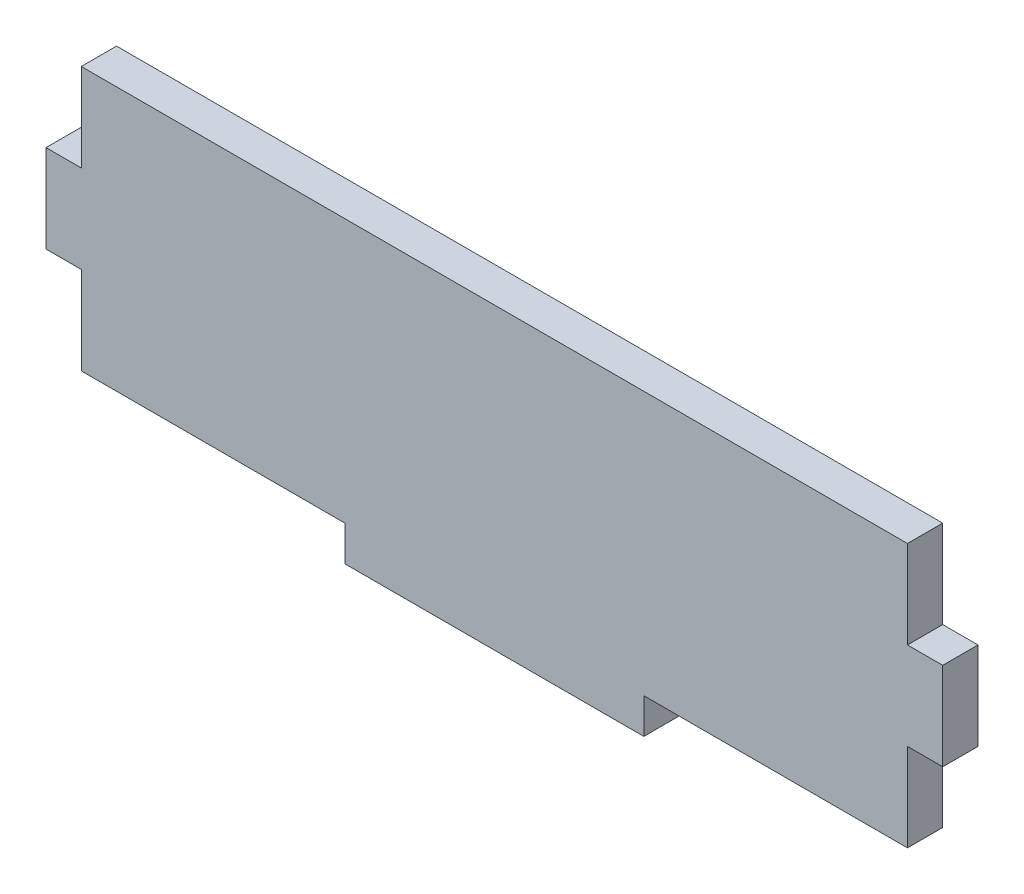
ISO-10303-21;
HEADER;
FILE_DESCRIPTION(('STEP AP214'),'2;1');
FILE_NAME('part.step','',(''),(''),'','','');
FILE_SCHEMA(('AUTOMOTIVE_DESIGN { 1 0 10303 214 1 1 1 1 }'));
ENDSEC;
DATA;
#1=APPLICATION_CONTEXT('core data for automotive mechanical design processes');
#2=APPLICATION_PROTOCOL_DEFINITION('international standard','automotive_design',2000,#1);
#3=PRODUCT_CONTEXT('',#1,'mechanical');
#4=PRODUCT('Part','Part','',(#3));
#5=PRODUCT_RELATED_PRODUCT_CATEGORY('part','',(#4));
#6=PRODUCT_DEFINITION_FORMATION('','',#4);
#7=PRODUCT_DEFINITION_CONTEXT('part definition',#1,'design');
#8=PRODUCT_DEFINITION('design','',#6,#7);
#9=PRODUCT_DEFINITION_SHAPE('','',#8);
#10=(LENGTH_UNIT() NAMED_UNIT(*) SI_UNIT(.MILLI.,.METRE.));
#11=(NAMED_UNIT(*) PLANE_ANGLE_UNIT() SI_UNIT($,.RADIAN.));
#12=(NAMED_UNIT(*) SI_UNIT($,.STERADIAN.) SOLID_ANGLE_UNIT());
#13=UNCERTAINTY_MEASURE_WITH_UNIT(LENGTH_MEASURE(1.E-05),#10,'distance_accuracy_value','');
#14=(GEOMETRIC_REPRESENTATION_CONTEXT(3) GLOBAL_UNCERTAINTY_ASSIGNED_CONTEXT((#13)) GLOBAL_UNIT_ASSIGNED_CONTEXT((#10,
#11,#12)) REPRESENTATION_CONTEXT('',''));
#15=CARTESIAN_POINT('',(0.,0.,0.));
#16=DIRECTION('',(0.,0.,1.));
#17=DIRECTION('',(1.,0.,0.));
#18=AXIS2_PLACEMENT_3D('',#15,#16,#17);
#19=CARTESIAN_POINT('',(-0.589841691178352,10.8692190927965,2.9972));
#20=DIRECTION('',(1.,0.,0.));
#21=DIRECTION('',(0.,1.,0.));
#22=AXIS2_PLACEMENT_3D('',#19,#20,#21);
#23=PLANE('',#22);
#24=DIRECTION('',(0.,-1.,0.));
#25=VECTOR('',#24,1.);
#26=CARTESIAN_POINT('',(-0.589841691178352,10.8692190927965,0.));
#27=LINE('',#26,#25);
#28=CARTESIAN_POINT('',(-0.589841691178351,18.3368190927965,0.));
#29=VERTEX_POINT('',#28);
#30=CARTESIAN_POINT('',(-0.589841691178352,10.8692190927965,0.));
#31=VERTEX_POINT('',#30);
#32=EDGE_CURVE('E176',#29,#31,#27,.T.);
#33=ORIENTED_EDGE('',*,*,#32,.T.);
#34=DIRECTION('',(0.,0.,-1.));
#35=VECTOR('',#34,1.);
#36=CARTESIAN_POINT('',(-0.589841691178352,10.8692190927965,2.9972));
#37=LINE('',#36,#35);
#38=CARTESIAN_POINT('',(-0.589841691178352,10.8692190927965,2.9972));
#39=VERTEX_POINT('',#38);
#40=EDGE_CURVE('E11',#39,#31,#37,.T.);
#41=ORIENTED_EDGE('',*,*,#40,.F.);
#42=DIRECTION('',(0.,-1.,0.));
#43=VECTOR('',#42,1.);
#44=CARTESIAN_POINT('',(-0.589841691178352,10.8692190927965,2.9972));
#45=LINE('',#44,#43);
#46=CARTESIAN_POINT('',(-0.589841691178351,18.3368190927965,2.9972));
#47=VERTEX_POINT('',#46);
#48=EDGE_CURVE('E206',#47,#39,#45,.T.);
#49=ORIENTED_EDGE('',*,*,#48,.F.);
#50=DIRECTION('',(0.,0.,-1.));
#51=VECTOR('',#50,1.);
#52=CARTESIAN_POINT('',(-0.589841691178351,18.3368190927965,2.9972));
#53=LINE('',#52,#51);
#54=EDGE_CURVE('E172',#47,#29,#53,.T.);
#55=ORIENTED_EDGE('',*,*,#54,.T.);
#56=EDGE_LOOP('',(#33,#41,#49,#55));
#57=FACE_BOUND('',#56,.T.);
#58=ADVANCED_FACE('F32',(#57),#23,.F.);
#59=CARTESIAN_POINT('',(-0.589841691178352,10.8692190927965,2.9972));
#60=DIRECTION('',(0.,1.,0.));
#61=DIRECTION('',(0.,0.,1.));
#62=AXIS2_PLACEMENT_3D('',#59,#60,#61);
#63=PLANE('',#62);
#64=DIRECTION('',(1.,0.,0.));
#65=VECTOR('',#64,1.);
#66=CARTESIAN_POINT('',(-0.589841691178352,10.8692190927965,0.));
#67=LINE('',#66,#65);
#68=CARTESIAN_POINT('',(21.8129583088216,10.8692190927965,0.));
#69=VERTEX_POINT('',#68);
#70=EDGE_CURVE('E179',#31,#69,#67,.T.);
#71=ORIENTED_EDGE('',*,*,#70,.T.);
#72=DIRECTION('',(0.,0.,-1.));
#73=VECTOR('',#72,1.);
#74=CARTESIAN_POINT('',(21.8129583088216,10.8692190927965,2.9972));
#75=LINE('',#74,#73);
#76=CARTESIAN_POINT('',(21.8129583088216,10.8692190927965,2.9972));
#77=VERTEX_POINT('',#76);
#78=EDGE_CURVE('E40',#77,#69,#75,.T.);
#79=ORIENTED_EDGE('',*,*,#78,.F.);
#80=DIRECTION('',(1.,0.,0.));
#81=VECTOR('',#80,1.);
#82=CARTESIAN_POINT('',(-0.589841691178352,10.8692190927965,2.9972));
#83=LINE('',#82,#81);
#84=EDGE_CURVE('E115',#39,#77,#83,.T.);
#85=ORIENTED_EDGE('',*,*,#84,.F.);
#86=ORIENTED_EDGE('',*,*,#40,.T.);
#87=EDGE_LOOP('',(#71,#79,#85,#86));
#88=FACE_BOUND('',#87,.T.);
#89=ADVANCED_FACE('F304',(#88),#63,.F.);
#90=CARTESIAN_POINT('',(21.8129583088216,7.87201909279651,2.9972));
#91=DIRECTION('',(1.,0.,0.));
#92=DIRECTION('',(0.,0.,-1.));
#93=AXIS2_PLACEMENT_3D('',#90,#91,#92);
#94=PLANE('',#93);
#95=DIRECTION('',(0.,-1.,0.));
#96=VECTOR('',#95,1.);
#97=CARTESIAN_POINT('',(21.8129583088216,7.87201909279651,0.));
#98=LINE('',#97,#96);
#99=CARTESIAN_POINT('',(21.8129583088216,7.87201909279651,0.));
#100=VERTEX_POINT('',#99);
#101=EDGE_CURVE('E181',#69,#100,#98,.T.);
#102=ORIENTED_EDGE('',*,*,#101,.T.);
#103=DIRECTION('',(0.,0.,-1.));
#104=VECTOR('',#103,1.);
#105=CARTESIAN_POINT('',(21.8129583088216,7.87201909279651,2.9972));
#106=LINE('',#105,#104);
#107=CARTESIAN_POINT('',(21.8129583088216,7.87201909279651,2.9972));
#108=VERTEX_POINT('',#107);
#109=EDGE_CURVE('E237',#108,#100,#106,.T.);
#110=ORIENTED_EDGE('',*,*,#109,.F.);
#111=DIRECTION('',(0.,-1.,0.));
#112=VECTOR('',#111,1.);
#113=CARTESIAN_POINT('',(21.8129583088216,7.87201909279651,2.9972));
#114=LINE('',#113,#112);
#115=EDGE_CURVE('E245',#77,#108,#114,.T.);
#116=ORIENTED_EDGE('',*,*,#115,.F.);
#117=ORIENTED_EDGE('',*,*,#78,.T.);
#118=EDGE_LOOP('',(#102,#110,#116,#117));
#119=FACE_BOUND('',#118,.T.);
#120=ADVANCED_FACE('F243',(#119),#94,.F.);
#121=CARTESIAN_POINT('',(21.8129583088216,7.87201909279651,2.9972));
#122=DIRECTION('',(0.,1.,0.));
#123=DIRECTION('',(0.,0.,1.));
#124=AXIS2_PLACEMENT_3D('',#121,#122,#123);
#125=PLANE('',#124);
#126=DIRECTION('',(1.,0.,0.));
#127=VECTOR('',#126,1.);
#128=CARTESIAN_POINT('',(21.8129583088216,7.87201909279651,0.));
#129=LINE('',#128,#127);
#130=CARTESIAN_POINT('',(47.2129583088216,7.87201909279651,0.));
#131=VERTEX_POINT('',#130);
#132=EDGE_CURVE('E183',#100,#131,#129,.T.);
#133=ORIENTED_EDGE('',*,*,#132,.T.);
#134=DIRECTION('',(0.,0.,-1.));
#135=VECTOR('',#134,1.);
#136=CARTESIAN_POINT('',(47.2129583088216,7.87201909279651,2.9972));
#137=LINE('',#136,#135);
#138=CARTESIAN_POINT('',(47.2129583088216,7.87201909279651,2.9972));
#139=VERTEX_POINT('',#138);
#140=EDGE_CURVE('E234',#139,#131,#137,.T.);
#141=ORIENTED_EDGE('',*,*,#140,.F.);
#142=DIRECTION('',(1.,0.,0.));
#143=VECTOR('',#142,1.);
#144=CARTESIAN_POINT('',(21.8129583088216,7.87201909279651,2.9972));
#145=LINE('',#144,#143);
#146=EDGE_CURVE('E263',#108,#139,#145,.T.);
#147=ORIENTED_EDGE('',*,*,#146,.F.);
#148=ORIENTED_EDGE('',*,*,#109,.T.);
#149=EDGE_LOOP('',(#133,#141,#147,#148));
#150=FACE_BOUND('',#149,.T.);
#151=ADVANCED_FACE('F254',(#150),#125,.F.);
#152=CARTESIAN_POINT('',(47.2129583088216,7.87201909279651,2.9972));
#153=DIRECTION('',(-1.,0.,0.));
#154=DIRECTION('',(0.,0.,1.));
#155=AXIS2_PLACEMENT_3D('',#152,#153,#154);
#156=PLANE('',#155);
#157=DIRECTION('',(0.,1.,0.));
#158=VECTOR('',#157,1.);
#159=CARTESIAN_POINT('',(47.2129583088216,7.87201909279651,0.));
#160=LINE('',#159,#158);
#161=CARTESIAN_POINT('',(47.2129583088216,10.8692190927965,0.));
#162=VERTEX_POINT('',#161);
#163=EDGE_CURVE('E185',#131,#162,#160,.T.);
#164=ORIENTED_EDGE('',*,*,#163,.T.);
#165=DIRECTION('',(0.,0.,-1.));
#166=VECTOR('',#165,1.);
#167=CARTESIAN_POINT('',(47.2129583088216,10.8692190927965,2.9972));
#168=LINE('',#167,#166);
#169=CARTESIAN_POINT('',(47.2129583088216,10.8692190927965,2.9972));
#170=VERTEX_POINT('',#169);
#171=EDGE_CURVE('E231',#170,#162,#168,.T.);
#172=ORIENTED_EDGE('',*,*,#171,.F.);
#173=DIRECTION('',(0.,1.,0.));
#174=VECTOR('',#173,1.);
#175=CARTESIAN_POINT('',(47.2129583088216,7.87201909279651,2.9972));
#176=LINE('',#175,#174);
#177=EDGE_CURVE('E260',#139,#170,#176,.T.);
#178=ORIENTED_EDGE('',*,*,#177,.F.);
#179=ORIENTED_EDGE('',*,*,#140,.T.);
#180=EDGE_LOOP('',(#164,#172,#178,#179));
#181=FACE_BOUND('',#180,.T.);
#182=ADVANCED_FACE('F258',(#181),#156,.F.);
#183=CARTESIAN_POINT('',(69.6157583088217,10.8692190927965,2.9972));
#184=DIRECTION('',(0.,1.,0.));
#185=DIRECTION('',(0.,0.,1.));
#186=AXIS2_PLACEMENT_3D('',#183,#184,#185);
#187=PLANE('',#186);
#188=DIRECTION('',(1.,0.,0.));
#189=VECTOR('',#188,1.);
#190=CARTESIAN_POINT('',(69.6157583088217,10.8692190927965,0.));
#191=LINE('',#190,#189);
#192=CARTESIAN_POINT('',(69.6157583088217,10.8692190927965,0.));
#193=VERTEX_POINT('',#192);
#194=EDGE_CURVE('E187',#162,#193,#191,.T.);
#195=ORIENTED_EDGE('',*,*,#194,.T.);
#196=DIRECTION('',(0.,0.,-1.));
#197=VECTOR('',#196,1.);
#198=CARTESIAN_POINT('',(69.6157583088217,10.8692190927965,2.9972));
#199=LINE('',#198,#197);
#200=CARTESIAN_POINT('',(69.6157583088217,10.8692190927965,2.9972));
#201=VERTEX_POINT('',#200);
#202=EDGE_CURVE('E228',#201,#193,#199,.T.);
#203=ORIENTED_EDGE('',*,*,#202,.F.);
#204=DIRECTION('',(1.,0.,0.));
#205=VECTOR('',#204,1.);
#206=CARTESIAN_POINT('',(69.6157583088217,10.8692190927965,2.9972));
#207=LINE('',#206,#205);
#208=EDGE_CURVE('E262',#170,#201,#207,.T.);
#209=ORIENTED_EDGE('',*,*,#208,.F.);
#210=ORIENTED_EDGE('',*,*,#171,.T.);
#211=EDGE_LOOP('',(#195,#203,#209,#210));
#212=FACE_BOUND('',#211,.T.);
#213=ADVANCED_FACE('F317',(#212),#187,.F.);
#214=CARTESIAN_POINT('',(69.6157583088217,10.8692190927965,2.9972));
#215=DIRECTION('',(-1.,0.,0.));
#216=DIRECTION('',(0.,0.,1.));
#217=AXIS2_PLACEMENT_3D('',#214,#215,#216);
#218=PLANE('',#217);
#219=DIRECTION('',(0.,1.,0.));
#220=VECTOR('',#219,1.);
#221=CARTESIAN_POINT('',(69.6157583088217,10.8692190927965,0.));
#222=LINE('',#221,#220);
#223=CARTESIAN_POINT('',(69.6157583088217,18.3368190927965,0.));
#224=VERTEX_POINT('',#223);
#225=EDGE_CURVE('E189',#193,#224,#222,.T.);
#226=ORIENTED_EDGE('',*,*,#225,.T.);
#227=DIRECTION('',(0.,0.,-1.));
#228=VECTOR('',#227,1.);
#229=CARTESIAN_POINT('',(69.6157583088217,18.3368190927965,2.9972));
#230=LINE('',#229,#228);
#231=CARTESIAN_POINT('',(69.6157583088217,18.3368190927965,2.9972));
#232=VERTEX_POINT('',#231);
#233=EDGE_CURVE('E225',#232,#224,#230,.T.);
#234=ORIENTED_EDGE('',*,*,#233,.F.);
#235=DIRECTION('',(0.,1.,0.));
#236=VECTOR('',#235,1.);
#237=CARTESIAN_POINT('',(69.6157583088217,10.8692190927965,2.9972));
#238=LINE('',#237,#236);
#239=EDGE_CURVE('E265',#201,#232,#238,.T.);
#240=ORIENTED_EDGE('',*,*,#239,.F.);
#241=ORIENTED_EDGE('',*,*,#202,.T.);
#242=EDGE_LOOP('',(#226,#234,#240,#241));
#243=FACE_BOUND('',#242,.T.);
#244=ADVANCED_FACE('F320',(#243),#218,.F.);
#245=CARTESIAN_POINT('',(72.6129583088217,18.3368190927965,2.9972));
#246=DIRECTION('',(0.,1.,0.));
#247=DIRECTION('',(0.,0.,1.));
#248=AXIS2_PLACEMENT_3D('',#245,#246,#247);
#249=PLANE('',#248);
#250=DIRECTION('',(1.,0.,0.));
#251=VECTOR('',#250,1.);
#252=CARTESIAN_POINT('',(72.6129583088217,18.3368190927965,0.));
#253=LINE('',#252,#251);
#254=CARTESIAN_POINT('',(72.6129583088217,18.3368190927965,0.));
#255=VERTEX_POINT('',#254);
#256=EDGE_CURVE('E191',#224,#255,#253,.T.);
#257=ORIENTED_EDGE('',*,*,#256,.T.);
#258=DIRECTION('',(0.,0.,-1.));
#259=VECTOR('',#258,1.);
#260=CARTESIAN_POINT('',(72.6129583088217,18.3368190927965,2.9972));
#261=LINE('',#260,#259);
#262=CARTESIAN_POINT('',(72.6129583088217,18.3368190927965,2.9972));
#263=VERTEX_POINT('',#262);
#264=EDGE_CURVE('E222',#263,#255,#261,.T.);
#265=ORIENTED_EDGE('',*,*,#264,.F.);
#266=DIRECTION('',(1.,0.,0.));
#267=VECTOR('',#266,1.);
#268=CARTESIAN_POINT('',(72.6129583088217,18.3368190927965,2.9972));
#269=LINE('',#268,#267);
#270=EDGE_CURVE('E271',#232,#263,#269,.T.);
#271=ORIENTED_EDGE('',*,*,#270,.F.);
#272=ORIENTED_EDGE('',*,*,#233,.T.);
#273=EDGE_LOOP('',(#257,#265,#271,#272));
#274=FACE_BOUND('',#273,.T.);
#275=ADVANCED_FACE('F324',(#274),#249,.F.);
#276=CARTESIAN_POINT('',(72.6129583088217,18.3368190927965,2.9972));
#277=DIRECTION('',(-1.,0.,0.));
#278=DIRECTION('',(0.,0.,1.));
#279=AXIS2_PLACEMENT_3D('',#276,#277,#278);
#280=PLANE('',#279);
#281=DIRECTION('',(0.,1.,0.));
#282=VECTOR('',#281,1.);
#283=CARTESIAN_POINT('',(72.6129583088217,18.3368190927965,0.));
#284=LINE('',#283,#282);
#285=CARTESIAN_POINT('',(72.6129583088217,25.8044190927965,0.));
#286=VERTEX_POINT('',#285);
#287=EDGE_CURVE('E193',#255,#286,#284,.T.);
#288=ORIENTED_EDGE('',*,*,#287,.T.);
#289=DIRECTION('',(0.,0.,-1.));
#290=VECTOR('',#289,1.);
#291=CARTESIAN_POINT('',(72.6129583088217,25.8044190927965,2.9972));
#292=LINE('',#291,#290);
#293=CARTESIAN_POINT('',(72.6129583088217,25.8044190927965,2.9972));
#294=VERTEX_POINT('',#293);
#295=EDGE_CURVE('E219',#294,#286,#292,.T.);
#296=ORIENTED_EDGE('',*,*,#295,.F.);
#297=DIRECTION('',(0.,1.,0.));
#298=VECTOR('',#297,1.);
#299=CARTESIAN_POINT('',(72.6129583088217,18.3368190927965,2.9972));
#300=LINE('',#299,#298);
#301=EDGE_CURVE('E273',#263,#294,#300,.T.);
#302=ORIENTED_EDGE('',*,*,#301,.F.);
#303=ORIENTED_EDGE('',*,*,#264,.T.);
#304=EDGE_LOOP('',(#288,#296,#302,#303));
#305=FACE_BOUND('',#304,.T.);
#306=ADVANCED_FACE('F328',(#305),#280,.F.);
#307=CARTESIAN_POINT('',(72.6129583088217,25.8044190927965,2.9972));
#308=DIRECTION('',(0.,-1.,0.));
#309=DIRECTION('',(0.,0.,-1.));
#310=AXIS2_PLACEMENT_3D('',#307,#308,#309);
#311=PLANE('',#310);
#312=DIRECTION('',(-1.,0.,0.));
#313=VECTOR('',#312,1.);
#314=CARTESIAN_POINT('',(72.6129583088217,25.8044190927965,0.));
#315=LINE('',#314,#313);
#316=CARTESIAN_POINT('',(69.6157583088217,25.8044190927965,0.));
#317=VERTEX_POINT('',#316);
#318=EDGE_CURVE('E195',#286,#317,#315,.T.);
#319=ORIENTED_EDGE('',*,*,#318,.T.);
#320=DIRECTION('',(0.,0.,-1.));
#321=VECTOR('',#320,1.);
#322=CARTESIAN_POINT('',(69.6157583088217,25.8044190927965,2.9972));
#323=LINE('',#322,#321);
#324=CARTESIAN_POINT('',(69.6157583088217,25.8044190927965,2.9972));
#325=VERTEX_POINT('',#324);
#326=EDGE_CURVE('E216',#325,#317,#323,.T.);
#327=ORIENTED_EDGE('',*,*,#326,.F.);
#328=DIRECTION('',(-1.,0.,0.));
#329=VECTOR('',#328,1.);
#330=CARTESIAN_POINT('',(72.6129583088217,25.8044190927965,2.9972));
#331=LINE('',#330,#329);
#332=EDGE_CURVE('E275',#294,#325,#331,.T.);
#333=ORIENTED_EDGE('',*,*,#332,.F.);
#334=ORIENTED_EDGE('',*,*,#295,.T.);
#335=EDGE_LOOP('',(#319,#327,#333,#334));
#336=FACE_BOUND('',#335,.T.);
#337=ADVANCED_FACE('F332',(#336),#311,.F.);
#338=CARTESIAN_POINT('',(69.6157583088217,33.2720190927965,2.9972));
#339=DIRECTION('',(-1.,0.,0.));
#340=DIRECTION('',(0.,0.,1.));
#341=AXIS2_PLACEMENT_3D('',#338,#339,#340);
#342=PLANE('',#341);
#343=DIRECTION('',(0.,1.,0.));
#344=VECTOR('',#343,1.);
#345=CARTESIAN_POINT('',(69.6157583088217,33.2720190927965,0.));
#346=LINE('',#345,#344);
#347=CARTESIAN_POINT('',(69.6157583088217,33.2720190927965,0.));
#348=VERTEX_POINT('',#347);
#349=EDGE_CURVE('E197',#317,#348,#346,.T.);
#350=ORIENTED_EDGE('',*,*,#349,.T.);
#351=DIRECTION('',(0.,0.,-1.));
#352=VECTOR('',#351,1.);
#353=CARTESIAN_POINT('',(69.6157583088217,33.2720190927965,2.9972));
#354=LINE('',#353,#352);
#355=CARTESIAN_POINT('',(69.6157583088217,33.2720190927965,2.9972));
#356=VERTEX_POINT('',#355);
#357=EDGE_CURVE('E213',#356,#348,#354,.T.);
#358=ORIENTED_EDGE('',*,*,#357,.F.);
#359=DIRECTION('',(0.,1.,0.));
#360=VECTOR('',#359,1.);
#361=CARTESIAN_POINT('',(69.6157583088217,33.2720190927965,2.9972));
#362=LINE('',#361,#360);
#363=EDGE_CURVE('E277',#325,#356,#362,.T.);
#364=ORIENTED_EDGE('',*,*,#363,.F.);
#365=ORIENTED_EDGE('',*,*,#326,.T.);
#366=EDGE_LOOP('',(#350,#358,#364,#365));
#367=FACE_BOUND('',#366,.T.);
#368=ADVANCED_FACE('F336',(#367),#342,.F.);
#369=CARTESIAN_POINT('',(-0.589841691178354,33.2720190927965,2.9972));
#370=DIRECTION('',(0.,-1.,0.));
#371=DIRECTION('',(0.,0.,-1.));
#372=AXIS2_PLACEMENT_3D('',#369,#370,#371);
#373=PLANE('',#372);
#374=DIRECTION('',(-1.,0.,0.));
#375=VECTOR('',#374,1.);
#376=CARTESIAN_POINT('',(-0.589841691178354,33.2720190927965,0.));
#377=LINE('',#376,#375);
#378=CARTESIAN_POINT('',(-0.589841691178354,33.2720190927965,0.));
#379=VERTEX_POINT('',#378);
#380=EDGE_CURVE('E199',#348,#379,#377,.T.);
#381=ORIENTED_EDGE('',*,*,#380,.T.);
#382=DIRECTION('',(0.,0.,-1.));
#383=VECTOR('',#382,1.);
#384=CARTESIAN_POINT('',(-0.589841691178354,33.2720190927965,2.9972));
#385=LINE('',#384,#383);
#386=CARTESIAN_POINT('',(-0.589841691178354,33.2720190927965,2.9972));
#387=VERTEX_POINT('',#386);
#388=EDGE_CURVE('E210',#387,#379,#385,.T.);
#389=ORIENTED_EDGE('',*,*,#388,.F.);
#390=DIRECTION('',(-1.,0.,0.));
#391=VECTOR('',#390,1.);
#392=CARTESIAN_POINT('',(-0.589841691178354,33.2720190927965,2.9972));
#393=LINE('',#392,#391);
#394=EDGE_CURVE('E279',#356,#387,#393,.T.);
#395=ORIENTED_EDGE('',*,*,#394,.F.);
#396=ORIENTED_EDGE('',*,*,#357,.T.);
#397=EDGE_LOOP('',(#381,#389,#395,#396));
#398=FACE_BOUND('',#397,.T.);
#399=ADVANCED_FACE('F285',(#398),#373,.F.);
#400=CARTESIAN_POINT('',(-0.589841691178354,33.2720190927965,2.9972));
#401=DIRECTION('',(1.,0.,0.));
#402=DIRECTION('',(0.,1.,0.));
#403=AXIS2_PLACEMENT_3D('',#400,#401,#402);
#404=PLANE('',#403);
#405=DIRECTION('',(0.,-1.,0.));
#406=VECTOR('',#405,1.);
#407=CARTESIAN_POINT('',(-0.589841691178354,33.2720190927965,0.));
#408=LINE('',#407,#406);
#409=CARTESIAN_POINT('',(-0.589841691178353,25.8044190927965,0.));
#410=VERTEX_POINT('',#409);
#411=EDGE_CURVE('E201',#379,#410,#408,.T.);
#412=ORIENTED_EDGE('',*,*,#411,.T.);
#413=DIRECTION('',(0.,0.,-1.));
#414=VECTOR('',#413,1.);
#415=CARTESIAN_POINT('',(-0.589841691178353,25.8044190927965,2.9972));
#416=LINE('',#415,#414);
#417=CARTESIAN_POINT('',(-0.589841691178353,25.8044190927965,2.9972));
#418=VERTEX_POINT('',#417);
#419=EDGE_CURVE('E167',#418,#410,#416,.T.);
#420=ORIENTED_EDGE('',*,*,#419,.F.);
#421=DIRECTION('',(0.,-1.,0.));
#422=VECTOR('',#421,1.);
#423=CARTESIAN_POINT('',(-0.589841691178354,33.2720190927965,2.9972));
#424=LINE('',#423,#422);
#425=EDGE_CURVE('E158',#387,#418,#424,.T.);
#426=ORIENTED_EDGE('',*,*,#425,.F.);
#427=ORIENTED_EDGE('',*,*,#388,.T.);
#428=EDGE_LOOP('',(#412,#420,#426,#427));
#429=FACE_BOUND('',#428,.T.);
#430=ADVANCED_FACE('F289',(#429),#404,.F.);
#431=CARTESIAN_POINT('',(-3.58704169117835,25.8044190927965,2.9972));
#432=DIRECTION('',(0.,-1.,0.));
#433=DIRECTION('',(0.,0.,-1.));
#434=AXIS2_PLACEMENT_3D('',#431,#432,#433);
#435=PLANE('',#434);
#436=DIRECTION('',(-1.,0.,0.));
#437=VECTOR('',#436,1.);
#438=CARTESIAN_POINT('',(-3.58704169117835,25.8044190927965,0.));
#439=LINE('',#438,#437);
#440=CARTESIAN_POINT('',(-3.58704169117835,25.8044190927965,0.));
#441=VERTEX_POINT('',#440);
#442=EDGE_CURVE('E166',#410,#441,#439,.T.);
#443=ORIENTED_EDGE('',*,*,#442,.T.);
#444=DIRECTION('',(0.,0.,-1.));
#445=VECTOR('',#444,1.);
#446=CARTESIAN_POINT('',(-3.58704169117835,25.8044190927965,2.9972));
#447=LINE('',#446,#445);
#448=CARTESIAN_POINT('',(-3.58704169117835,25.8044190927965,2.9972));
#449=VERTEX_POINT('',#448);
#450=EDGE_CURVE('E163',#449,#441,#447,.T.);
#451=ORIENTED_EDGE('',*,*,#450,.F.);
#452=DIRECTION('',(-1.,0.,0.));
#453=VECTOR('',#452,1.);
#454=CARTESIAN_POINT('',(-3.58704169117835,25.8044190927965,2.9972));
#455=LINE('',#454,#453);
#456=EDGE_CURVE('E152',#418,#449,#455,.T.);
#457=ORIENTED_EDGE('',*,*,#456,.F.);
#458=ORIENTED_EDGE('',*,*,#419,.T.);
#459=EDGE_LOOP('',(#443,#451,#457,#458));
#460=FACE_BOUND('',#459,.T.);
#461=ADVANCED_FACE('F164',(#460),#435,.F.);
#462=CARTESIAN_POINT('',(-3.58704169117835,18.3368190927965,2.9972));
#463=DIRECTION('',(1.,0.,0.));
#464=DIRECTION('',(0.,0.,-1.));
#465=AXIS2_PLACEMENT_3D('',#462,#463,#464);
#466=PLANE('',#465);
#467=DIRECTION('',(0.,-1.,0.));
#468=VECTOR('',#467,1.);
#469=CARTESIAN_POINT('',(-3.58704169117835,18.3368190927965,0.));
#470=LINE('',#469,#468);
#471=CARTESIAN_POINT('',(-3.58704169117835,18.3368190927965,0.));
#472=VERTEX_POINT('',#471);
#473=EDGE_CURVE('E101',#441,#472,#470,.T.);
#474=ORIENTED_EDGE('',*,*,#473,.T.);
#475=DIRECTION('',(0.,0.,-1.));
#476=VECTOR('',#475,1.);
#477=CARTESIAN_POINT('',(-3.58704169117835,18.3368190927965,2.9972));
#478=LINE('',#477,#476);
#479=CARTESIAN_POINT('',(-3.58704169117835,18.3368190927965,2.9972));
#480=VERTEX_POINT('',#479);
#481=EDGE_CURVE('E168',#480,#472,#478,.T.);
#482=ORIENTED_EDGE('',*,*,#481,.F.);
#483=DIRECTION('',(0.,-1.,0.));
#484=VECTOR('',#483,1.);
#485=CARTESIAN_POINT('',(-3.58704169117835,18.3368190927965,2.9972));
#486=LINE('',#485,#484);
#487=EDGE_CURVE('E156',#449,#480,#486,.T.);
#488=ORIENTED_EDGE('',*,*,#487,.F.);
#489=ORIENTED_EDGE('',*,*,#450,.T.);
#490=EDGE_LOOP('',(#474,#482,#488,#489));
#491=FACE_BOUND('',#490,.T.);
#492=ADVANCED_FACE('F170',(#491),#466,.F.);
#493=CARTESIAN_POINT('',(-3.58704169117835,18.3368190927965,2.9972));
#494=DIRECTION('',(0.,1.,0.));
#495=DIRECTION('',(0.,0.,1.));
#496=AXIS2_PLACEMENT_3D('',#493,#494,#495);
#497=PLANE('',#496);
#498=DIRECTION('',(1.,0.,0.));
#499=VECTOR('',#498,1.);
#500=CARTESIAN_POINT('',(-3.58704169117835,18.3368190927965,0.));
#501=LINE('',#500,#499);
#502=EDGE_CURVE('E107',#472,#29,#501,.T.);
#503=ORIENTED_EDGE('',*,*,#502,.T.);
#504=ORIENTED_EDGE('',*,*,#54,.F.);
#505=DIRECTION('',(1.,0.,0.));
#506=VECTOR('',#505,1.);
#507=CARTESIAN_POINT('',(-3.58704169117835,18.3368190927965,2.9972));
#508=LINE('',#507,#506);
#509=EDGE_CURVE('E48',#480,#47,#508,.T.);
#510=ORIENTED_EDGE('',*,*,#509,.F.);
#511=ORIENTED_EDGE('',*,*,#481,.T.);
#512=EDGE_LOOP('',(#503,#504,#510,#511));
#513=FACE_BOUND('',#512,.T.);
#514=ADVANCED_FACE('F293',(#513),#497,.F.);
#515=CARTESIAN_POINT('',(-0.589841691178351,18.3368190927965,2.9972));
#516=DIRECTION('',(0.,0.,-1.));
#517=DIRECTION('',(-1.,0.,0.));
#518=AXIS2_PLACEMENT_3D('',#515,#516,#517);
#519=PLANE('',#518);
#520=ORIENTED_EDGE('',*,*,#48,.T.);
#521=ORIENTED_EDGE('',*,*,#84,.T.);
#522=ORIENTED_EDGE('',*,*,#115,.T.);
#523=ORIENTED_EDGE('',*,*,#146,.T.);
#524=ORIENTED_EDGE('',*,*,#177,.T.);
#525=ORIENTED_EDGE('',*,*,#208,.T.);
#526=ORIENTED_EDGE('',*,*,#239,.T.);
#527=ORIENTED_EDGE('',*,*,#270,.T.);
#528=ORIENTED_EDGE('',*,*,#301,.T.);
#529=ORIENTED_EDGE('',*,*,#332,.T.);
#530=ORIENTED_EDGE('',*,*,#363,.T.);
#531=ORIENTED_EDGE('',*,*,#394,.T.);
#532=ORIENTED_EDGE('',*,*,#425,.T.);
#533=ORIENTED_EDGE('',*,*,#456,.T.);
#534=ORIENTED_EDGE('',*,*,#487,.T.);
#535=ORIENTED_EDGE('',*,*,#509,.T.);
#536=EDGE_LOOP('',(#520,#521,#522,#523,#524,#525,#526,#527,#528,#529,#530,#531,#532,#533,#534,#535));
#537=FACE_BOUND('',#536,.T.);
#538=ADVANCED_FACE('F154',(#537),#519,.F.);
#539=CARTESIAN_POINT('',(-0.589841691178351,18.3368190927965,0.));
#540=DIRECTION('',(0.,0.,-1.));
#541=DIRECTION('',(-1.,0.,0.));
#542=AXIS2_PLACEMENT_3D('',#539,#540,#541);
#543=PLANE('',#542);
#544=ORIENTED_EDGE('',*,*,#32,.F.);
#545=ORIENTED_EDGE('',*,*,#502,.F.);
#546=ORIENTED_EDGE('',*,*,#473,.F.);
#547=ORIENTED_EDGE('',*,*,#442,.F.);
#548=ORIENTED_EDGE('',*,*,#411,.F.);
#549=ORIENTED_EDGE('',*,*,#380,.F.);
#550=ORIENTED_EDGE('',*,*,#349,.F.);
#551=ORIENTED_EDGE('',*,*,#318,.F.);
#552=ORIENTED_EDGE('',*,*,#287,.F.);
#553=ORIENTED_EDGE('',*,*,#256,.F.);
#554=ORIENTED_EDGE('',*,*,#225,.F.);
#555=ORIENTED_EDGE('',*,*,#194,.F.);
#556=ORIENTED_EDGE('',*,*,#163,.F.);
#557=ORIENTED_EDGE('',*,*,#132,.F.);
#558=ORIENTED_EDGE('',*,*,#101,.F.);
#559=ORIENTED_EDGE('',*,*,#70,.F.);
#560=EDGE_LOOP('',(#544,#545,#546,#547,#548,#549,#550,#551,#552,#553,#554,#555,#556,#557,#558,#559));
#561=FACE_BOUND('',#560,.T.);
#562=ADVANCED_FACE('F249',(#561),#543,.T.);
#563=CLOSED_SHELL('',(#58,#89,#120,#151,#182,#213,#244,#275,#306,#337,#368,#399,#430,#461,#492,
#514,#538,#562));
#564=MANIFOLD_SOLID_BREP('B2',#563);
#565=ADVANCED_BREP_SHAPE_REPRESENTATION('',(#18,#564),#14);
#566=SHAPE_DEFINITION_REPRESENTATION(#9,#565);
ENDSEC;
END-ISO-10303-21;
